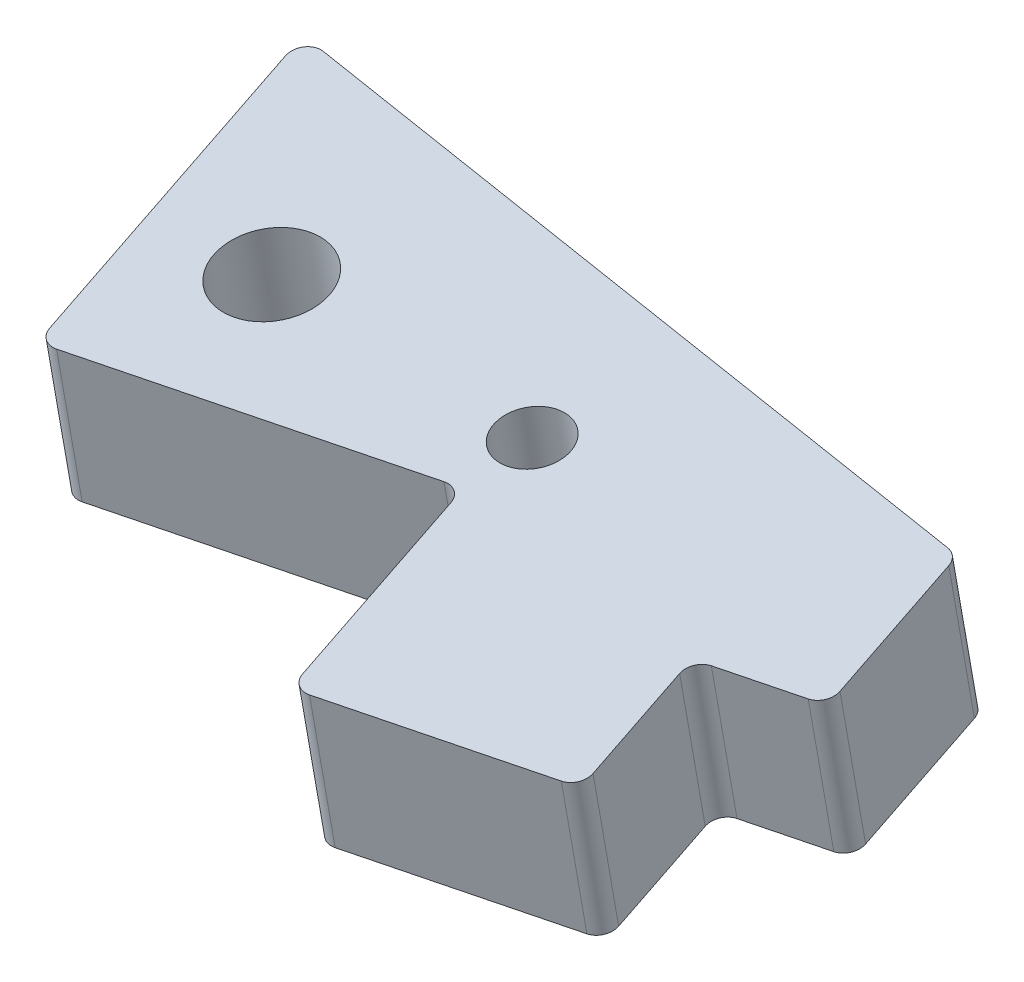
ISO-10303-21;
HEADER;
FILE_DESCRIPTION(('STEP AP214'),'2;1');
FILE_NAME('part.step','',(''),(''),'','','');
FILE_SCHEMA(('AUTOMOTIVE_DESIGN { 1 0 10303 214 1 1 1 1 }'));
ENDSEC;
DATA;
#1=APPLICATION_CONTEXT('core data for automotive mechanical design processes');
#2=APPLICATION_PROTOCOL_DEFINITION('international standard','automotive_design',2000,#1);
#3=PRODUCT_CONTEXT('',#1,'mechanical');
#4=PRODUCT('Part','Part','',(#3));
#5=PRODUCT_RELATED_PRODUCT_CATEGORY('part','',(#4));
#6=PRODUCT_DEFINITION_FORMATION('','',#4);
#7=PRODUCT_DEFINITION_CONTEXT('part definition',#1,'design');
#8=PRODUCT_DEFINITION('design','',#6,#7);
#9=PRODUCT_DEFINITION_SHAPE('','',#8);
#10=(LENGTH_UNIT() NAMED_UNIT(*) SI_UNIT(.MILLI.,.METRE.));
#11=(NAMED_UNIT(*) PLANE_ANGLE_UNIT() SI_UNIT($,.RADIAN.));
#12=(NAMED_UNIT(*) SI_UNIT($,.STERADIAN.) SOLID_ANGLE_UNIT());
#13=UNCERTAINTY_MEASURE_WITH_UNIT(LENGTH_MEASURE(1.E-05),#10,'distance_accuracy_value','');
#14=(GEOMETRIC_REPRESENTATION_CONTEXT(3) GLOBAL_UNCERTAINTY_ASSIGNED_CONTEXT((#13)) GLOBAL_UNIT_ASSIGNED_CONTEXT((#10,
#11,#12)) REPRESENTATION_CONTEXT('',''));
#15=CARTESIAN_POINT('',(0.,0.,0.));
#16=DIRECTION('',(0.,0.,1.));
#17=DIRECTION('',(1.,0.,0.));
#18=AXIS2_PLACEMENT_3D('',#15,#16,#17);
#19=CARTESIAN_POINT('',(1.48264605087706,-5.59152061245951,-7.21488704289835));
#20=DIRECTION('',(0.,-0.984807753012208,-0.173648177666931));
#21=DIRECTION('',(0.,0.173648177666931,-0.984807753012208));
#22=AXIS2_PLACEMENT_3D('',#19,#20,#21);
#23=PLANE('',#22);
#24=CARTESIAN_POINT('',(27.4820083750125,18.2691753817678,-142.535618438385));
#25=DIRECTION('',(0.,0.984807753012208,0.173648177666931));
#26=DIRECTION('',(0.,0.173648177666931,-0.984807753012208));
#27=AXIS2_PLACEMENT_3D('',#24,#25,#26);
#28=CIRCLE('',#27,2.);
#29=CARTESIAN_POINT('',(27.4820083750125,18.6164717371016,-144.505233944409));
#30=VERTEX_POINT('',#29);
#31=EDGE_CURVE('E181',#30,#30,#28,.T.);
#32=ORIENTED_EDGE('',*,*,#31,.F.);
#33=EDGE_LOOP('',(#32));
#34=FACE_BOUND('',#33,.T.);
#35=CARTESIAN_POINT('',(11.0000000000006,18.3709337955762,-143.112719080609));
#36=DIRECTION('',(0.,0.984807753012208,0.17364817766693));
#37=DIRECTION('',(0.,0.17364817766693,-0.984807753012208));
#38=AXIS2_PLACEMENT_3D('',#35,#36,#37);
#39=CIRCLE('',#38,3.);
#40=CARTESIAN_POINT('',(11.0000000000006,18.891878328577,-146.067142339646));
#41=VERTEX_POINT('',#40);
#42=EDGE_CURVE('E11',#41,#41,#39,.T.);
#43=ORIENTED_EDGE('',*,*,#42,.F.);
#44=EDGE_LOOP('',(#43));
#45=FACE_BOUND('',#44,.T.);
#46=CARTESIAN_POINT('',(6.58649623132198,16.9653380397224,-135.141189424703));
#47=DIRECTION('',(0.,0.984807753012209,0.173648177666928));
#48=DIRECTION('',(0.,0.173648177666928,-0.984807753012209));
#49=AXIS2_PLACEMENT_3D('',#46,#47,#48);
#50=CIRCLE('',#49,1.);
#51=CARTESIAN_POINT('',(5.60834863058837,16.929234553496,-134.936436379643));
#52=VERTEX_POINT('',#51);
#53=CARTESIAN_POINT('',(6.79440792213971,16.7954844913656,-134.177902083911));
#54=VERTEX_POINT('',#53);
#55=EDGE_CURVE('E240',#52,#54,#50,.T.);
#56=ORIENTED_EDGE('',*,*,#55,.T.);
#57=DIRECTION('',(0.978147600733807,0.03610348622615,-0.204753045059201));
#58=VECTOR('',#57,1.);
#59=CARTESIAN_POINT('',(26.3573599368158,17.5175542158887,-138.272962985095));
#60=LINE('',#59,#58);
#61=CARTESIAN_POINT('',(26.3573599368159,17.5175542158887,-138.272962985095));
#62=VERTEX_POINT('',#61);
#63=EDGE_CURVE('E227',#54,#62,#60,.T.);
#64=ORIENTED_EDGE('',*,*,#63,.T.);
#65=CARTESIAN_POINT('',(26.5652716276336,17.3477006675319,-137.309675644302));
#66=DIRECTION('',(0.,-0.984807753012209,-0.173648177666928));
#67=DIRECTION('',(0.,0.173648177666928,-0.984807753012209));
#68=AXIS2_PLACEMENT_3D('',#65,#66,#67);
#69=CIRCLE('',#68,1.);
#70=CARTESIAN_POINT('',(27.5434192283674,17.3838041537581,-137.514428689361));
#71=VERTEX_POINT('',#70);
#72=EDGE_CURVE('E193',#62,#71,#69,.T.);
#73=ORIENTED_EDGE('',*,*,#72,.T.);
#74=DIRECTION('',(0.207911690817754,-0.169853548356707,0.963287340792943));
#75=VECTOR('',#74,1.);
#76=CARTESIAN_POINT('',(30.0383595181805,15.3455615734776,-125.954980599846));
#77=LINE('',#76,#75);
#78=CARTESIAN_POINT('',(30.0383595181805,15.3455615734776,-125.954980599846));
#79=VERTEX_POINT('',#78);
#80=EDGE_CURVE('E131',#71,#79,#77,.T.);
#81=ORIENTED_EDGE('',*,*,#80,.T.);
#82=CARTESIAN_POINT('',(31.0165071189143,15.3816650597037,-126.159733644905));
#83=DIRECTION('',(0.,0.984807753012208,0.17364817766693));
#84=DIRECTION('',(0.,0.17364817766693,-0.984807753012208));
#85=AXIS2_PLACEMENT_3D('',#82,#83,#84);
#86=CIRCLE('',#85,0.999999999999976);
#87=CARTESIAN_POINT('',(31.224418809732,15.211811511347,-125.196446304112));
#88=VERTEX_POINT('',#87);
#89=EDGE_CURVE('E124',#79,#88,#86,.T.);
#90=ORIENTED_EDGE('',*,*,#89,.T.);
#91=DIRECTION('',(0.978147600733808,0.0361034862261494,-0.204753045059198));
#92=VECTOR('',#91,1.);
#93=CARTESIAN_POINT('',(43.9403376192715,15.681156832287,-127.858235889881));
#94=LINE('',#93,#92);
#95=CARTESIAN_POINT('',(43.9403376192715,15.681156832287,-127.858235889881));
#96=VERTEX_POINT('',#95);
#97=EDGE_CURVE('E128',#88,#96,#94,.T.);
#98=ORIENTED_EDGE('',*,*,#97,.T.);
#99=CARTESIAN_POINT('',(43.7324259284538,15.8510103806437,-128.821523230674));
#100=DIRECTION('',(0.,0.984807753012208,0.173648177666931));
#101=DIRECTION('',(0.,0.173648177666931,-0.984807753012208));
#102=AXIS2_PLACEMENT_3D('',#99,#100,#101);
#103=CIRCLE('',#102,1.);
#104=CARTESIAN_POINT('',(44.7105735291878,15.8871138668697,-129.026276275733));
#105=VERTEX_POINT('',#104);
#106=EDGE_CURVE('E239',#96,#105,#103,.T.);
#107=ORIENTED_EDGE('',*,*,#106,.T.);
#108=DIRECTION('',(-0.207911690817752,0.169853548356707,-0.963287340792943));
#109=VECTOR('',#108,1.);
#110=CARTESIAN_POINT('',(43.2551916934633,17.0760887053668,-135.769287661284));
#111=LINE('',#110,#109);
#112=CARTESIAN_POINT('',(43.2551916934633,17.0760887053668,-135.769287661284));
#113=VERTEX_POINT('',#112);
#114=EDGE_CURVE('E159',#105,#113,#111,.T.);
#115=ORIENTED_EDGE('',*,*,#114,.T.);
#116=CARTESIAN_POINT('',(44.2333392941971,17.112192191593,-135.974040706343));
#117=DIRECTION('',(0.,-0.984807753012208,-0.173648177666929));
#118=DIRECTION('',(0.,0.173648177666929,-0.984807753012208));
#119=AXIS2_PLACEMENT_3D('',#116,#117,#118);
#120=CIRCLE('',#119,0.999999999999976);
#121=CARTESIAN_POINT('',(44.0254276033794,17.2820457399496,-136.937328047136));
#122=VERTEX_POINT('',#121);
#123=EDGE_CURVE('E175',#113,#122,#120,.T.);
#124=ORIENTED_EDGE('',*,*,#123,.T.);
#125=DIRECTION('',(0.978147600733805,0.0361034862261512,-0.204753045059208));
#126=VECTOR('',#125,1.);
#127=CARTESIAN_POINT('',(48.9161656070484,17.4625631710804,-137.961093272432));
#128=LINE('',#127,#126);
#129=CARTESIAN_POINT('',(48.9161656070484,17.4625631710804,-137.961093272432));
#130=VERTEX_POINT('',#129);
#131=EDGE_CURVE('E235',#122,#130,#128,.T.);
#132=ORIENTED_EDGE('',*,*,#131,.T.);
#133=CARTESIAN_POINT('',(48.7082539162307,17.6324167194371,-138.924380613225));
#134=DIRECTION('',(0.,0.984807753012208,0.173648177666932));
#135=DIRECTION('',(0.,0.173648177666932,-0.984807753012208));
#136=AXIS2_PLACEMENT_3D('',#133,#134,#135);
#137=CIRCLE('',#136,0.999999999999976);
#138=CARTESIAN_POINT('',(49.6864015169647,17.6685202056631,-139.129133658284));
#139=VERTEX_POINT('',#138);
#140=EDGE_CURVE('E187',#130,#139,#137,.T.);
#141=ORIENTED_EDGE('',*,*,#140,.T.);
#142=DIRECTION('',(-0.207911690817087,0.169853548356731,-0.963287340793082));
#143=VECTOR('',#142,1.);
#144=CARTESIAN_POINT('',(47.8568674710795,19.1631588587941,-147.605650678683));
#145=LINE('',#144,#143);
#146=CARTESIAN_POINT('',(47.8568674710825,19.1631588587942,-147.605650678684));
#147=VERTEX_POINT('',#146);
#148=EDGE_CURVE('E169',#139,#147,#145,.T.);
#149=ORIENTED_EDGE('',*,*,#148,.T.);
#150=CARTESIAN_POINT('',(46.8787198703398,19.1270553725678,-147.400897633623));
#151=DIRECTION('',(0.,0.984807753012208,0.173648177666929));
#152=DIRECTION('',(0.,0.173648177666929,-0.984807753012208));
#153=AXIS2_PLACEMENT_3D('',#150,#151,#152);
#154=CIRCLE('',#153,1.00000000000902);
#155=CARTESIAN_POINT('',(47.0176009878697,19.2990207362426,-148.376161674236));
#156=VERTEX_POINT('',#155);
#157=EDGE_CURVE('E210',#147,#156,#154,.T.);
#158=ORIENTED_EDGE('',*,*,#157,.T.);
#159=DIRECTION('',(-0.990309060442318,0.0241164529711037,-0.136771201288667));
#160=VECTOR('',#159,1.);
#161=CARTESIAN_POINT('',(2.76002320638325,20.3768012350957,-154.488558622919));
#162=LINE('',#161,#160);
#163=CARTESIAN_POINT('',(2.76002320638283,20.3768012350952,-154.488558622916));
#164=VERTEX_POINT('',#163);
#165=EDGE_CURVE('E222',#156,#164,#162,.T.);
#166=ORIENTED_EDGE('',*,*,#165,.T.);
#167=CARTESIAN_POINT('',(2.62114208885447,20.2048358714218,-153.513294582311));
#168=DIRECTION('',(0.,0.984807753012208,0.173648177666932));
#169=DIRECTION('',(0.,0.173648177666932,-0.984807753012208));
#170=AXIS2_PLACEMENT_3D('',#167,#168,#169);
#171=CIRCLE('',#170,1.00000000000299);
#172=CARTESIAN_POINT('',(1.64299448812067,20.1687323851956,-153.308541537252));
#173=VERTEX_POINT('',#172);
#174=EDGE_CURVE('E212',#164,#173,#171,.T.);
#175=ORIENTED_EDGE('',*,*,#174,.T.);
#176=DIRECTION('',(0.207911690817753,-0.169853548356707,0.963287340792943));
#177=VECTOR('',#176,1.);
#178=CARTESIAN_POINT('',(5.60834863058818,16.9292345534962,-134.936436379644));
#179=LINE('',#178,#177);
#180=EDGE_CURVE('E200',#173,#52,#179,.T.);
#181=ORIENTED_EDGE('',*,*,#180,.T.);
#182=EDGE_LOOP('',(#56,#64,#73,#81,#90,#98,#107,#115,#124,#132,#141,#149,#158,#166,#175,#181));
#183=FACE_BOUND('',#182,.T.);
#184=ADVANCED_FACE('F16',(#34,#45,#183),#23,.F.);
#185=CARTESIAN_POINT('',(11.0000000000007,74.0709562697928,-133.291302292337));
#186=DIRECTION('',(0.,-0.984807753012208,-0.17364817766693));
#187=DIRECTION('',(0.,0.17364817766693,-0.984807753012208));
#188=AXIS2_PLACEMENT_3D('',#185,#186,#187);
#189=CYLINDRICAL_SURFACE('',#188,3.);
#190=ORIENTED_EDGE('',*,*,#42,.T.);
#191=EDGE_LOOP('',(#190));
#192=FACE_BOUND('',#191,.T.);
#193=CARTESIAN_POINT('',(11.0000000000005,9.50766401846634,-144.675552679612));
#194=DIRECTION('',(0.,-0.984807753012208,-0.17364817766693));
#195=DIRECTION('',(0.,0.17364817766693,-0.984807753012208));
#196=AXIS2_PLACEMENT_3D('',#193,#194,#195);
#197=CIRCLE('',#196,3.);
#198=CARTESIAN_POINT('',(11.0000000000005,10.0286085514671,-147.629975938648));
#199=VERTEX_POINT('',#198);
#200=EDGE_CURVE('E27',#199,#199,#197,.T.);
#201=ORIENTED_EDGE('',*,*,#200,.T.);
#202=EDGE_LOOP('',(#201));
#203=FACE_BOUND('',#202,.T.);
#204=ADVANCED_FACE('F611',(#192,#203),#189,.F.);
#205=CARTESIAN_POINT('',(6.58649623132196,8.10206826261249,-136.704023023706));
#206=DIRECTION('',(0.,-0.984807753012208,-0.173648177666931));
#207=DIRECTION('',(0.,0.173648177666931,-0.984807753012208));
#208=AXIS2_PLACEMENT_3D('',#205,#206,#207);
#209=PLANE('',#208);
#210=CARTESIAN_POINT('',(27.4820083750125,9.40590560465791,-144.098452037387));
#211=DIRECTION('',(0.,-0.984807753012208,-0.173648177666931));
#212=DIRECTION('',(0.,0.173648177666931,-0.984807753012208));
#213=AXIS2_PLACEMENT_3D('',#210,#211,#212);
#214=CIRCLE('',#213,2.);
#215=CARTESIAN_POINT('',(27.4820083750125,9.75320195999177,-146.068067543412));
#216=VERTEX_POINT('',#215);
#217=EDGE_CURVE('E177',#216,#216,#214,.T.);
#218=ORIENTED_EDGE('',*,*,#217,.F.);
#219=EDGE_LOOP('',(#218));
#220=FACE_BOUND('',#219,.T.);
#221=ORIENTED_EDGE('',*,*,#200,.F.);
#222=EDGE_LOOP('',(#221));
#223=FACE_BOUND('',#222,.T.);
#224=CARTESIAN_POINT('',(6.58649623132196,8.10206826261249,-136.704023023706));
#225=DIRECTION('',(0.,-0.984807753012208,-0.173648177666929));
#226=DIRECTION('',(0.,0.173648177666929,-0.984807753012208));
#227=AXIS2_PLACEMENT_3D('',#224,#225,#226);
#228=CIRCLE('',#227,1.);
#229=CARTESIAN_POINT('',(6.79440792213971,7.93221471425579,-135.740735682913));
#230=VERTEX_POINT('',#229);
#231=CARTESIAN_POINT('',(5.60834863058815,8.06596477638634,-136.499269978647));
#232=VERTEX_POINT('',#231);
#233=EDGE_CURVE('E182',#230,#232,#228,.T.);
#234=ORIENTED_EDGE('',*,*,#233,.T.);
#235=DIRECTION('',(-0.207911690817753,0.169853548356707,-0.963287340792943));
#236=VECTOR('',#235,1.);
#237=CARTESIAN_POINT('',(5.60834863058815,8.06596477638634,-136.499269978647));
#238=LINE('',#237,#236);
#239=CARTESIAN_POINT('',(1.64299448812064,11.3054626080858,-154.871375136254));
#240=VERTEX_POINT('',#239);
#241=EDGE_CURVE('E199',#232,#240,#238,.T.);
#242=ORIENTED_EDGE('',*,*,#241,.T.);
#243=CARTESIAN_POINT('',(2.62114208885444,11.3415660943119,-155.076128181314));
#244=DIRECTION('',(0.,-0.984807753012208,-0.173648177666932));
#245=DIRECTION('',(0.,0.173648177666932,-0.984807753012208));
#246=AXIS2_PLACEMENT_3D('',#243,#244,#245);
#247=CIRCLE('',#246,1.00000000000299);
#248=CARTESIAN_POINT('',(2.7600232063828,11.5135314579853,-156.051392221918));
#249=VERTEX_POINT('',#248);
#250=EDGE_CURVE('E219',#240,#249,#247,.T.);
#251=ORIENTED_EDGE('',*,*,#250,.T.);
#252=DIRECTION('',(0.990309060442318,-0.0241164529711038,0.136771201288667));
#253=VECTOR('',#252,1.);
#254=CARTESIAN_POINT('',(2.76002320638322,11.5135314579858,-156.051392221922));
#255=LINE('',#254,#253);
#256=CARTESIAN_POINT('',(47.0176009878694,10.4357509591328,-149.938995273239));
#257=VERTEX_POINT('',#256);
#258=EDGE_CURVE('E206',#249,#257,#255,.T.);
#259=ORIENTED_EDGE('',*,*,#258,.T.);
#260=CARTESIAN_POINT('',(46.8787198703398,10.2637855954579,-148.963731232625));
#261=DIRECTION('',(0.,-0.984807753012208,-0.173648177666929));
#262=DIRECTION('',(0.,0.173648177666929,-0.984807753012208));
#263=AXIS2_PLACEMENT_3D('',#260,#261,#262);
#264=CIRCLE('',#263,1.00000000000902);
#265=CARTESIAN_POINT('',(47.8568674710824,10.2998890816843,-149.168484277686));
#266=VERTEX_POINT('',#265);
#267=EDGE_CURVE('E165',#257,#266,#264,.T.);
#268=ORIENTED_EDGE('',*,*,#267,.T.);
#269=DIRECTION('',(0.207911690817087,-0.169853548356732,0.963287340793082));
#270=VECTOR('',#269,1.);
#271=CARTESIAN_POINT('',(47.8568674710795,10.2998890816842,-149.168484277686));
#272=LINE('',#271,#270);
#273=CARTESIAN_POINT('',(49.6864015169644,8.8052504285534,-140.691967257287));
#274=VERTEX_POINT('',#273);
#275=EDGE_CURVE('E183',#266,#274,#272,.T.);
#276=ORIENTED_EDGE('',*,*,#275,.T.);
#277=CARTESIAN_POINT('',(48.7082539162306,8.76914694232726,-140.487214212228));
#278=DIRECTION('',(0.,-0.984807753012208,-0.173648177666932));
#279=DIRECTION('',(0.,0.173648177666932,-0.984807753012208));
#280=AXIS2_PLACEMENT_3D('',#277,#278,#279);
#281=CIRCLE('',#280,0.999999999999976);
#282=CARTESIAN_POINT('',(48.9161656070484,8.59929339397055,-139.523926871435));
#283=VERTEX_POINT('',#282);
#284=EDGE_CURVE('E231',#274,#283,#281,.T.);
#285=ORIENTED_EDGE('',*,*,#284,.T.);
#286=DIRECTION('',(-0.978147600733805,-0.0361034862261509,0.204753045059208));
#287=VECTOR('',#286,1.);
#288=CARTESIAN_POINT('',(48.9161656070484,8.59929339397055,-139.523926871435));
#289=LINE('',#288,#287);
#290=CARTESIAN_POINT('',(44.0254276033794,8.4187759628398,-138.500161646139));
#291=VERTEX_POINT('',#290);
#292=EDGE_CURVE('E171',#283,#291,#289,.T.);
#293=ORIENTED_EDGE('',*,*,#292,.T.);
#294=CARTESIAN_POINT('',(44.2333392941971,8.2489224144831,-137.536874305346));
#295=DIRECTION('',(0.,0.984807753012208,0.17364817766693));
#296=DIRECTION('',(0.,0.17364817766693,-0.984807753012208));
#297=AXIS2_PLACEMENT_3D('',#294,#295,#296);
#298=CIRCLE('',#297,0.999999999999976);
#299=CARTESIAN_POINT('',(43.2551916934633,8.21281892825695,-137.332121260287));
#300=VERTEX_POINT('',#299);
#301=EDGE_CURVE('E164',#291,#300,#298,.T.);
#302=ORIENTED_EDGE('',*,*,#301,.T.);
#303=DIRECTION('',(0.207911690817752,-0.169853548356707,0.963287340792943));
#304=VECTOR('',#303,1.);
#305=CARTESIAN_POINT('',(43.2551916934633,8.21281892825694,-137.332121260287));
#306=LINE('',#305,#304);
#307=CARTESIAN_POINT('',(44.7105735291875,7.02384408976,-130.589109874736));
#308=VERTEX_POINT('',#307);
#309=EDGE_CURVE('E257',#300,#308,#306,.T.);
#310=ORIENTED_EDGE('',*,*,#309,.T.);
#311=CARTESIAN_POINT('',(43.7324259284538,6.98774060353384,-130.384356829677));
#312=DIRECTION('',(0.,-0.984807753012208,-0.173648177666932));
#313=DIRECTION('',(0.,0.173648177666932,-0.984807753012208));
#314=AXIS2_PLACEMENT_3D('',#311,#312,#313);
#315=CIRCLE('',#314,1.);
#316=CARTESIAN_POINT('',(43.9403376192715,6.81788705517714,-129.421069488884));
#317=VERTEX_POINT('',#316);
#318=EDGE_CURVE('E151',#308,#317,#315,.T.);
#319=ORIENTED_EDGE('',*,*,#318,.T.);
#320=DIRECTION('',(-0.978147600733808,-0.0361034862261493,0.204753045059198));
#321=VECTOR('',#320,1.);
#322=CARTESIAN_POINT('',(43.9403376192715,6.81788705517713,-129.421069488884));
#323=LINE('',#322,#321);
#324=CARTESIAN_POINT('',(31.224418809732,6.34854173423719,-126.759279903114));
#325=VERTEX_POINT('',#324);
#326=EDGE_CURVE('E20',#317,#325,#323,.T.);
#327=ORIENTED_EDGE('',*,*,#326,.T.);
#328=CARTESIAN_POINT('',(31.0165071189142,6.51839528259389,-127.722567243907));
#329=DIRECTION('',(0.,-0.984807753012208,-0.17364817766693));
#330=DIRECTION('',(0.,0.17364817766693,-0.984807753012208));
#331=AXIS2_PLACEMENT_3D('',#328,#329,#330);
#332=CIRCLE('',#331,0.999999999999976);
#333=CARTESIAN_POINT('',(30.0383595181804,6.48229179636775,-127.517814198848));
#334=VERTEX_POINT('',#333);
#335=EDGE_CURVE('E142',#325,#334,#332,.T.);
#336=ORIENTED_EDGE('',*,*,#335,.T.);
#337=DIRECTION('',(-0.207911690817754,0.169853548356707,-0.963287340792942));
#338=VECTOR('',#337,1.);
#339=CARTESIAN_POINT('',(30.0383595181804,6.48229179636774,-127.517814198848));
#340=LINE('',#339,#338);
#341=CARTESIAN_POINT('',(27.5434192283674,8.52053437664823,-139.077262288363));
#342=VERTEX_POINT('',#341);
#343=EDGE_CURVE('E189',#334,#342,#340,.T.);
#344=ORIENTED_EDGE('',*,*,#343,.T.);
#345=CARTESIAN_POINT('',(26.5652716276336,8.48443089042208,-138.872509243304));
#346=DIRECTION('',(0.,0.984807753012208,0.173648177666929));
#347=DIRECTION('',(0.,0.173648177666929,-0.984807753012208));
#348=AXIS2_PLACEMENT_3D('',#345,#346,#347);
#349=CIRCLE('',#348,1.);
#350=CARTESIAN_POINT('',(26.3573599368158,8.65428443877878,-139.835796584097));
#351=VERTEX_POINT('',#350);
#352=EDGE_CURVE('E205',#342,#351,#349,.T.);
#353=ORIENTED_EDGE('',*,*,#352,.T.);
#354=DIRECTION('',(-0.978147600733807,-0.0361034862261498,0.204753045059201));
#355=VECTOR('',#354,1.);
#356=CARTESIAN_POINT('',(26.3573599368158,8.65428443877879,-139.835796584097));
#357=LINE('',#356,#355);
#358=EDGE_CURVE('E243',#351,#230,#357,.T.);
#359=ORIENTED_EDGE('',*,*,#358,.T.);
#360=EDGE_LOOP('',(#234,#242,#251,#259,#268,#276,#285,#293,#302,#310,#319,#327,#336,#344,#353,#359));
#361=FACE_BOUND('',#360,.T.);
#362=ADVANCED_FACE('F606',(#220,#223,#361),#209,.T.);
#363=CARTESIAN_POINT('',(27.4820083750126,73.9691978559844,-132.714201650112));
#364=DIRECTION('',(0.,-0.984807753012209,-0.173648177666928));
#365=DIRECTION('',(0.,0.173648177666928,-0.984807753012209));
#366=AXIS2_PLACEMENT_3D('',#363,#364,#365);
#367=CYLINDRICAL_SURFACE('',#366,2.);
#368=ORIENTED_EDGE('',*,*,#31,.T.);
#369=EDGE_LOOP('',(#368));
#370=FACE_BOUND('',#369,.T.);
#371=ORIENTED_EDGE('',*,*,#217,.T.);
#372=EDGE_LOOP('',(#371));
#373=FACE_BOUND('',#372,.T.);
#374=ADVANCED_FACE('F610',(#370,#373),#367,.F.);
#375=CARTESIAN_POINT('',(6.58649623132217,72.665360513939,-125.319772636431));
#376=DIRECTION('',(0.,-0.984807753012207,-0.173648177666935));
#377=DIRECTION('',(0.,0.173648177666935,-0.984807753012207));
#378=AXIS2_PLACEMENT_3D('',#375,#376,#377);
#379=CYLINDRICAL_SURFACE('',#378,1.);
#380=ORIENTED_EDGE('',*,*,#55,.F.);
#381=DIRECTION('',(0.,-0.984807753012208,-0.173648177666931));
#382=VECTOR('',#381,1.);
#383=CARTESIAN_POINT('',(5.60834863058837,72.6292570277128,-125.115019591372));
#384=LINE('',#383,#382);
#385=EDGE_CURVE('E215',#52,#232,#384,.T.);
#386=ORIENTED_EDGE('',*,*,#385,.T.);
#387=ORIENTED_EDGE('',*,*,#233,.F.);
#388=DIRECTION('',(0.,-0.984807753012208,-0.173648177666931));
#389=VECTOR('',#388,1.);
#390=CARTESIAN_POINT('',(6.79440792213993,72.4955069655823,-124.356485295638));
#391=LINE('',#390,#389);
#392=EDGE_CURVE('E251',#54,#230,#391,.T.);
#393=ORIENTED_EDGE('',*,*,#392,.F.);
#394=EDGE_LOOP('',(#380,#386,#387,#393));
#395=FACE_BOUND('',#394,.T.);
#396=ADVANCED_FACE('F600',(#395),#379,.T.);
#397=CARTESIAN_POINT('',(26.357359936816,73.2175766901053,-128.451546196822));
#398=DIRECTION('',(0.207911690817753,-0.169853548356707,0.963287340792943));
#399=DIRECTION('',(-0.63266639870422,-0.774424449478858,0.));
#400=AXIS2_PLACEMENT_3D('',#397,#398,#399);
#401=PLANE('',#400);
#402=ORIENTED_EDGE('',*,*,#63,.F.);
#403=ORIENTED_EDGE('',*,*,#392,.T.);
#404=ORIENTED_EDGE('',*,*,#358,.F.);
#405=DIRECTION('',(0.,-0.984807753012208,-0.173648177666931));
#406=VECTOR('',#405,1.);
#407=CARTESIAN_POINT('',(26.357359936816,73.2175766901053,-128.451546196822));
#408=LINE('',#407,#406);
#409=EDGE_CURVE('E201',#62,#351,#408,.T.);
#410=ORIENTED_EDGE('',*,*,#409,.F.);
#411=EDGE_LOOP('',(#402,#403,#404,#410));
#412=FACE_BOUND('',#411,.T.);
#413=ADVANCED_FACE('F595',(#412),#401,.T.);
#414=CARTESIAN_POINT('',(26.5652716276338,73.0477231417486,-127.488258856029));
#415=DIRECTION('',(0.,-0.984807753012207,-0.173648177666935));
#416=DIRECTION('',(0.,0.173648177666935,-0.984807753012207));
#417=AXIS2_PLACEMENT_3D('',#414,#415,#416);
#418=CYLINDRICAL_SURFACE('',#417,1.);
#419=ORIENTED_EDGE('',*,*,#72,.F.);
#420=ORIENTED_EDGE('',*,*,#409,.T.);
#421=ORIENTED_EDGE('',*,*,#352,.F.);
#422=DIRECTION('',(0.,-0.984807753012208,-0.173648177666931));
#423=VECTOR('',#422,1.);
#424=CARTESIAN_POINT('',(27.5434192283676,73.0838266279747,-127.693011901089));
#425=LINE('',#424,#423);
#426=EDGE_CURVE('E194',#71,#342,#425,.T.);
#427=ORIENTED_EDGE('',*,*,#426,.F.);
#428=EDGE_LOOP('',(#419,#420,#421,#427));
#429=FACE_BOUND('',#428,.T.);
#430=ADVANCED_FACE('F599',(#429),#418,.F.);
#431=CARTESIAN_POINT('',(30.0383595181807,71.0455840476942,-116.133563811573));
#432=DIRECTION('',(-0.978147600733807,-0.0361034862261502,0.204753045059202));
#433=DIRECTION('',(-0.0368849429895255,0.999319518963109,0.));
#434=AXIS2_PLACEMENT_3D('',#431,#432,#433);
#435=PLANE('',#434);
#436=ORIENTED_EDGE('',*,*,#80,.F.);
#437=ORIENTED_EDGE('',*,*,#426,.T.);
#438=ORIENTED_EDGE('',*,*,#343,.F.);
#439=DIRECTION('',(0.,-0.984807753012208,-0.173648177666931));
#440=VECTOR('',#439,1.);
#441=CARTESIAN_POINT('',(30.0383595181807,71.0455840476942,-116.133563811573));
#442=LINE('',#441,#440);
#443=EDGE_CURVE('E136',#79,#334,#442,.T.);
#444=ORIENTED_EDGE('',*,*,#443,.F.);
#445=EDGE_LOOP('',(#436,#437,#438,#444));
#446=FACE_BOUND('',#445,.T.);
#447=ADVANCED_FACE('F590',(#446),#435,.T.);
#448=CARTESIAN_POINT('',(31.0165071189145,71.0816875339204,-116.338316856632));
#449=DIRECTION('',(0.,-0.984807753012209,-0.173648177666926));
#450=DIRECTION('',(0.,0.173648177666926,-0.984807753012209));
#451=AXIS2_PLACEMENT_3D('',#448,#449,#450);
#452=CYLINDRICAL_SURFACE('',#451,0.999999999999975);
#453=ORIENTED_EDGE('',*,*,#89,.F.);
#454=ORIENTED_EDGE('',*,*,#443,.T.);
#455=ORIENTED_EDGE('',*,*,#335,.F.);
#456=DIRECTION('',(0.,-0.984807753012208,-0.173648177666931));
#457=VECTOR('',#456,1.);
#458=CARTESIAN_POINT('',(31.2244188097322,70.9118339855637,-115.37502951584));
#459=LINE('',#458,#457);
#460=EDGE_CURVE('E139',#88,#325,#459,.T.);
#461=ORIENTED_EDGE('',*,*,#460,.F.);
#462=EDGE_LOOP('',(#453,#454,#455,#461));
#463=FACE_BOUND('',#462,.T.);
#464=ADVANCED_FACE('F140',(#463),#452,.T.);
#465=CARTESIAN_POINT('',(43.9403376192717,71.3811793065036,-118.036819101609));
#466=DIRECTION('',(0.20791169081775,-0.169853548356707,0.963287340792943));
#467=DIRECTION('',(-0.632666398704228,-0.774424449478852,0.));
#468=AXIS2_PLACEMENT_3D('',#465,#466,#467);
#469=PLANE('',#468);
#470=ORIENTED_EDGE('',*,*,#97,.F.);
#471=ORIENTED_EDGE('',*,*,#460,.T.);
#472=ORIENTED_EDGE('',*,*,#326,.F.);
#473=DIRECTION('',(0.,-0.984807753012208,-0.173648177666931));
#474=VECTOR('',#473,1.);
#475=CARTESIAN_POINT('',(43.9403376192717,71.3811793065036,-118.036819101609));
#476=LINE('',#475,#474);
#477=EDGE_CURVE('E148',#96,#317,#476,.T.);
#478=ORIENTED_EDGE('',*,*,#477,.F.);
#479=EDGE_LOOP('',(#470,#471,#472,#478));
#480=FACE_BOUND('',#479,.T.);
#481=ADVANCED_FACE('F18',(#480),#469,.T.);
#482=CARTESIAN_POINT('',(43.7324259284539,71.5510328548603,-119.000106442402));
#483=DIRECTION('',(0.,-0.984807753012208,-0.173648177666932));
#484=DIRECTION('',(0.,0.173648177666932,-0.984807753012208));
#485=AXIS2_PLACEMENT_3D('',#482,#483,#484);
#486=CYLINDRICAL_SURFACE('',#485,1.00000000000002);
#487=ORIENTED_EDGE('',*,*,#106,.F.);
#488=ORIENTED_EDGE('',*,*,#477,.T.);
#489=ORIENTED_EDGE('',*,*,#318,.F.);
#490=DIRECTION('',(0.,-0.984807753012208,-0.173648177666931));
#491=VECTOR('',#490,1.);
#492=CARTESIAN_POINT('',(44.7105735291878,71.5871363410865,-119.204859487461));
#493=LINE('',#492,#491);
#494=EDGE_CURVE('E163',#105,#308,#493,.T.);
#495=ORIENTED_EDGE('',*,*,#494,.F.);
#496=EDGE_LOOP('',(#487,#488,#489,#495));
#497=FACE_BOUND('',#496,.T.);
#498=ADVANCED_FACE('F547',(#497),#486,.T.);
#499=CARTESIAN_POINT('',(43.2551916934635,72.7761111795834,-125.947870873012));
#500=DIRECTION('',(0.978147600733807,0.03610348622615,-0.204753045059201));
#501=DIRECTION('',(0.,-0.984807753012211,-0.173648177666916));
#502=AXIS2_PLACEMENT_3D('',#499,#500,#501);
#503=PLANE('',#502);
#504=ORIENTED_EDGE('',*,*,#114,.F.);
#505=ORIENTED_EDGE('',*,*,#494,.T.);
#506=ORIENTED_EDGE('',*,*,#309,.F.);
#507=DIRECTION('',(0.,-0.984807753012208,-0.173648177666931));
#508=VECTOR('',#507,1.);
#509=CARTESIAN_POINT('',(43.2551916934636,72.7761111795834,-125.947870873012));
#510=LINE('',#509,#508);
#511=EDGE_CURVE('E247',#113,#300,#510,.T.);
#512=ORIENTED_EDGE('',*,*,#511,.F.);
#513=EDGE_LOOP('',(#504,#505,#506,#512));
#514=FACE_BOUND('',#513,.T.);
#515=ADVANCED_FACE('F551',(#514),#503,.T.);
#516=CARTESIAN_POINT('',(44.2333392941973,72.8122146658096,-126.152623918071));
#517=DIRECTION('',(0.,-0.984807753012209,-0.173648177666926));
#518=DIRECTION('',(0.,0.173648177666926,-0.984807753012209));
#519=AXIS2_PLACEMENT_3D('',#516,#517,#518);
#520=CYLINDRICAL_SURFACE('',#519,0.999999999999975);
#521=ORIENTED_EDGE('',*,*,#123,.F.);
#522=ORIENTED_EDGE('',*,*,#511,.T.);
#523=ORIENTED_EDGE('',*,*,#301,.F.);
#524=DIRECTION('',(0.,-0.984807753012208,-0.173648177666931));
#525=VECTOR('',#524,1.);
#526=CARTESIAN_POINT('',(44.0254276033795,72.9820682141663,-127.115911258864));
#527=LINE('',#526,#525);
#528=EDGE_CURVE('E176',#122,#291,#527,.T.);
#529=ORIENTED_EDGE('',*,*,#528,.F.);
#530=EDGE_LOOP('',(#521,#522,#523,#529));
#531=FACE_BOUND('',#530,.T.);
#532=ADVANCED_FACE('F573',(#531),#520,.F.);
#533=CARTESIAN_POINT('',(48.9161656070486,73.162585645297,-128.13967648416));
#534=DIRECTION('',(0.20791169081776,-0.169853548356707,0.963287340792941));
#535=DIRECTION('',(-0.632666398704207,-0.774424449478869,0.));
#536=AXIS2_PLACEMENT_3D('',#533,#534,#535);
#537=PLANE('',#536);
#538=ORIENTED_EDGE('',*,*,#131,.F.);
#539=ORIENTED_EDGE('',*,*,#528,.T.);
#540=ORIENTED_EDGE('',*,*,#292,.F.);
#541=DIRECTION('',(0.,-0.984807753012208,-0.173648177666931));
#542=VECTOR('',#541,1.);
#543=CARTESIAN_POINT('',(48.9161656070486,73.162585645297,-128.13967648416));
#544=LINE('',#543,#542);
#545=EDGE_CURVE('E236',#130,#283,#544,.T.);
#546=ORIENTED_EDGE('',*,*,#545,.F.);
#547=EDGE_LOOP('',(#538,#539,#540,#546));
#548=FACE_BOUND('',#547,.T.);
#549=ADVANCED_FACE('F568',(#548),#537,.T.);
#550=CARTESIAN_POINT('',(48.7082539162309,73.3324391936537,-129.102963824953));
#551=DIRECTION('',(0.,-0.984807753012209,-0.173648177666926));
#552=DIRECTION('',(0.,0.173648177666926,-0.984807753012209));
#553=AXIS2_PLACEMENT_3D('',#550,#551,#552);
#554=CYLINDRICAL_SURFACE('',#553,0.999999999999975);
#555=ORIENTED_EDGE('',*,*,#140,.F.);
#556=ORIENTED_EDGE('',*,*,#545,.T.);
#557=ORIENTED_EDGE('',*,*,#284,.F.);
#558=DIRECTION('',(0.,-0.984807753012208,-0.173648177666931));
#559=VECTOR('',#558,1.);
#560=CARTESIAN_POINT('',(49.6864015169647,73.3685426798799,-129.307716870012));
#561=LINE('',#560,#559);
#562=EDGE_CURVE('E188',#139,#274,#561,.T.);
#563=ORIENTED_EDGE('',*,*,#562,.F.);
#564=EDGE_LOOP('',(#555,#556,#557,#563));
#565=FACE_BOUND('',#564,.T.);
#566=ADVANCED_FACE('F572',(#565),#554,.T.);
#567=CARTESIAN_POINT('',(47.8568674710797,74.8631813330107,-137.784233890411));
#568=DIRECTION('',(0.978147600733948,0.0361034862260343,-0.204753045058545));
#569=DIRECTION('',(0.,-0.984807753012211,-0.173648177666916));
#570=AXIS2_PLACEMENT_3D('',#567,#568,#569);
#571=PLANE('',#570);
#572=ORIENTED_EDGE('',*,*,#148,.F.);
#573=ORIENTED_EDGE('',*,*,#562,.T.);
#574=ORIENTED_EDGE('',*,*,#275,.F.);
#575=DIRECTION('',(0.,-0.984807753012208,-0.173648177666931));
#576=VECTOR('',#575,1.);
#577=CARTESIAN_POINT('',(47.8568674710826,74.8631813330108,-137.784233890412));
#578=LINE('',#577,#576);
#579=EDGE_CURVE('E170',#147,#266,#578,.T.);
#580=ORIENTED_EDGE('',*,*,#579,.F.);
#581=EDGE_LOOP('',(#572,#573,#574,#580));
#582=FACE_BOUND('',#581,.T.);
#583=ADVANCED_FACE('F617',(#582),#571,.T.);
#584=CARTESIAN_POINT('',(46.87871987034,74.8270778467844,-137.57948084535));
#585=DIRECTION('',(0.,-0.984807753012209,-0.173648177666923));
#586=DIRECTION('',(0.,0.173648177666923,-0.984807753012209));
#587=AXIS2_PLACEMENT_3D('',#584,#585,#586);
#588=CYLINDRICAL_SURFACE('',#587,1.00000000000902);
#589=ORIENTED_EDGE('',*,*,#157,.F.);
#590=ORIENTED_EDGE('',*,*,#579,.T.);
#591=ORIENTED_EDGE('',*,*,#267,.F.);
#592=DIRECTION('',(0.,-0.984807753012208,-0.173648177666931));
#593=VECTOR('',#592,1.);
#594=CARTESIAN_POINT('',(47.0176009878697,74.9990432104593,-138.554744885964));
#595=LINE('',#594,#593);
#596=EDGE_CURVE('E211',#156,#257,#595,.T.);
#597=ORIENTED_EDGE('',*,*,#596,.F.);
#598=EDGE_LOOP('',(#589,#590,#591,#597));
#599=FACE_BOUND('',#598,.T.);
#600=ADVANCED_FACE('F621',(#599),#588,.T.);
#601=CARTESIAN_POINT('',(2.76002320638344,76.0768237093123,-144.667141834647));
#602=DIRECTION('',(0.138881117528095,0.171965363672859,-0.975264040601831));
#603=DIRECTION('',(-0.990012256662626,0.,-0.140981316697547));
#604=AXIS2_PLACEMENT_3D('',#601,#602,#603);
#605=PLANE('',#604);
#606=ORIENTED_EDGE('',*,*,#165,.F.);
#607=ORIENTED_EDGE('',*,*,#596,.T.);
#608=ORIENTED_EDGE('',*,*,#258,.F.);
#609=DIRECTION('',(0.,-0.984807753012208,-0.173648177666931));
#610=VECTOR('',#609,1.);
#611=CARTESIAN_POINT('',(2.76002320638302,76.0768237093118,-144.667141834644));
#612=LINE('',#611,#610);
#613=EDGE_CURVE('E214',#164,#249,#612,.T.);
#614=ORIENTED_EDGE('',*,*,#613,.F.);
#615=EDGE_LOOP('',(#606,#607,#608,#614));
#616=FACE_BOUND('',#615,.T.);
#617=ADVANCED_FACE('F562',(#616),#605,.T.);
#618=CARTESIAN_POINT('',(2.62114208885466,75.9048583456384,-143.691877794039));
#619=DIRECTION('',(0.,-0.984807753012208,-0.173648177666929));
#620=DIRECTION('',(0.,0.173648177666929,-0.984807753012208));
#621=AXIS2_PLACEMENT_3D('',#618,#619,#620);
#622=CYLINDRICAL_SURFACE('',#621,1.00000000000299);
#623=ORIENTED_EDGE('',*,*,#174,.F.);
#624=ORIENTED_EDGE('',*,*,#613,.T.);
#625=ORIENTED_EDGE('',*,*,#250,.F.);
#626=DIRECTION('',(0.,-0.984807753012208,-0.173648177666931));
#627=VECTOR('',#626,1.);
#628=CARTESIAN_POINT('',(1.64299448812085,75.8687548594122,-143.48712474898));
#629=LINE('',#628,#627);
#630=EDGE_CURVE('E195',#173,#240,#629,.T.);
#631=ORIENTED_EDGE('',*,*,#630,.F.);
#632=EDGE_LOOP('',(#623,#624,#625,#631));
#633=FACE_BOUND('',#632,.T.);
#634=ADVANCED_FACE('F557',(#633),#622,.T.);
#635=CARTESIAN_POINT('',(5.60834863058837,72.6292570277128,-125.115019591372));
#636=DIRECTION('',(-0.978147600733807,-0.03610348622615,0.204753045059201));
#637=DIRECTION('',(-0.0368849429895253,0.999319518963109,0.));
#638=AXIS2_PLACEMENT_3D('',#635,#636,#637);
#639=PLANE('',#638);
#640=ORIENTED_EDGE('',*,*,#180,.F.);
#641=ORIENTED_EDGE('',*,*,#630,.T.);
#642=ORIENTED_EDGE('',*,*,#241,.F.);
#643=ORIENTED_EDGE('',*,*,#385,.F.);
#644=EDGE_LOOP('',(#640,#641,#642,#643));
#645=FACE_BOUND('',#644,.T.);
#646=ADVANCED_FACE('F561',(#645),#639,.T.);
#647=CLOSED_SHELL('',(#184,#204,#362,#374,#396,#413,#430,#447,#464,#481,#498,#515,#532,#549,
#566,#583,#600,#617,#634,#646));
#648=MANIFOLD_SOLID_BREP('B1',#647);
#649=ADVANCED_BREP_SHAPE_REPRESENTATION('',(#18,#648),#14);
#650=SHAPE_DEFINITION_REPRESENTATION(#9,#649);
ENDSEC;
END-ISO-10303-21;
